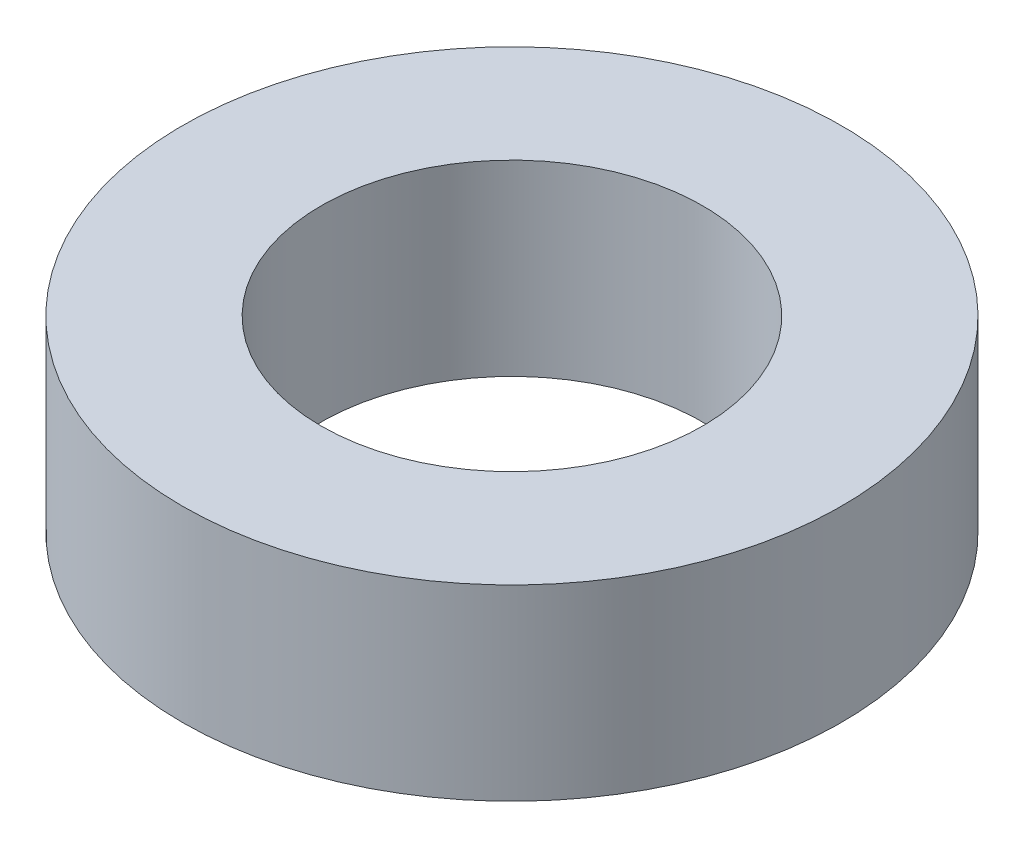
ISO-10303-21;
HEADER;
FILE_DESCRIPTION(('STEP AP214'),'2;1');
FILE_NAME('part.step','',(''),(''),'','','');
FILE_SCHEMA(('AUTOMOTIVE_DESIGN { 1 0 10303 214 1 1 1 1 }'));
ENDSEC;
DATA;
#1=APPLICATION_CONTEXT('core data for automotive mechanical design processes');
#2=APPLICATION_PROTOCOL_DEFINITION('international standard','automotive_design',2000,#1);
#3=PRODUCT_CONTEXT('',#1,'mechanical');
#4=PRODUCT('Part','Part','',(#3));
#5=PRODUCT_RELATED_PRODUCT_CATEGORY('part','',(#4));
#6=PRODUCT_DEFINITION_FORMATION('','',#4);
#7=PRODUCT_DEFINITION_CONTEXT('part definition',#1,'design');
#8=PRODUCT_DEFINITION('design','',#6,#7);
#9=PRODUCT_DEFINITION_SHAPE('','',#8);
#10=(LENGTH_UNIT() NAMED_UNIT(*) SI_UNIT(.MILLI.,.METRE.));
#11=(NAMED_UNIT(*) PLANE_ANGLE_UNIT() SI_UNIT($,.RADIAN.));
#12=(NAMED_UNIT(*) SI_UNIT($,.STERADIAN.) SOLID_ANGLE_UNIT());
#13=UNCERTAINTY_MEASURE_WITH_UNIT(LENGTH_MEASURE(1.E-05),#10,'distance_accuracy_value','');
#14=(GEOMETRIC_REPRESENTATION_CONTEXT(3) GLOBAL_UNCERTAINTY_ASSIGNED_CONTEXT((#13)) GLOBAL_UNIT_ASSIGNED_CONTEXT((#10,
#11,#12)) REPRESENTATION_CONTEXT('',''));
#15=CARTESIAN_POINT('',(0.,0.,0.));
#16=DIRECTION('',(0.,0.,1.));
#17=DIRECTION('',(1.,0.,0.));
#18=AXIS2_PLACEMENT_3D('',#15,#16,#17);
#19=CARTESIAN_POINT('',(0.,27.,0.));
#20=DIRECTION('',(0.,-1.,0.));
#21=DIRECTION('',(0.,0.,-1.));
#22=AXIS2_PLACEMENT_3D('',#19,#20,#21);
#23=CYLINDRICAL_SURFACE('',#22,47.5);
#24=CARTESIAN_POINT('',(0.,27.,0.));
#25=DIRECTION('',(0.,1.,0.));
#26=DIRECTION('',(0.,0.,1.));
#27=AXIS2_PLACEMENT_3D('',#24,#25,#26);
#28=CIRCLE('',#27,47.5);
#29=CARTESIAN_POINT('',(0.,27.,47.5));
#30=VERTEX_POINT('',#29);
#31=EDGE_CURVE('E10',#30,#30,#28,.T.);
#32=ORIENTED_EDGE('',*,*,#31,.F.);
#33=EDGE_LOOP('',(#32));
#34=FACE_BOUND('',#33,.T.);
#35=CARTESIAN_POINT('',(0.,0.,0.));
#36=DIRECTION('',(0.,1.,0.));
#37=DIRECTION('',(0.,0.,1.));
#38=AXIS2_PLACEMENT_3D('',#35,#36,#37);
#39=CIRCLE('',#38,47.5);
#40=CARTESIAN_POINT('',(0.,0.,47.5));
#41=VERTEX_POINT('',#40);
#42=EDGE_CURVE('E37',#41,#41,#39,.T.);
#43=ORIENTED_EDGE('',*,*,#42,.T.);
#44=EDGE_LOOP('',(#43));
#45=FACE_BOUND('',#44,.T.);
#46=ADVANCED_FACE('F40',(#34,#45),#23,.T.);
#47=CARTESIAN_POINT('',(0.,27.,0.));
#48=DIRECTION('',(0.,1.,0.));
#49=DIRECTION('',(0.,0.,1.));
#50=AXIS2_PLACEMENT_3D('',#47,#48,#49);
#51=PLANE('',#50);
#52=CARTESIAN_POINT('',(0.,27.,0.));
#53=DIRECTION('',(0.,1.,0.));
#54=DIRECTION('',(0.,0.,1.));
#55=AXIS2_PLACEMENT_3D('',#52,#53,#54);
#56=CIRCLE('',#55,27.5);
#57=CARTESIAN_POINT('',(0.,27.,27.5));
#58=VERTEX_POINT('',#57);
#59=EDGE_CURVE('E50',#58,#58,#56,.T.);
#60=ORIENTED_EDGE('',*,*,#59,.F.);
#61=EDGE_LOOP('',(#60));
#62=FACE_BOUND('',#61,.T.);
#63=ORIENTED_EDGE('',*,*,#31,.T.);
#64=EDGE_LOOP('',(#63));
#65=FACE_BOUND('',#64,.T.);
#66=ADVANCED_FACE('F59',(#62,#65),#51,.T.);
#67=CARTESIAN_POINT('',(0.,0.,0.));
#68=DIRECTION('',(0.,1.,0.));
#69=DIRECTION('',(0.,0.,1.));
#70=AXIS2_PLACEMENT_3D('',#67,#68,#69);
#71=PLANE('',#70);
#72=CARTESIAN_POINT('',(0.,0.,0.));
#73=DIRECTION('',(0.,1.,0.));
#74=DIRECTION('',(0.,0.,1.));
#75=AXIS2_PLACEMENT_3D('',#72,#73,#74);
#76=CIRCLE('',#75,27.5);
#77=CARTESIAN_POINT('',(0.,0.,27.5));
#78=VERTEX_POINT('',#77);
#79=EDGE_CURVE('E47',#78,#78,#76,.T.);
#80=ORIENTED_EDGE('',*,*,#79,.T.);
#81=EDGE_LOOP('',(#80));
#82=FACE_BOUND('',#81,.T.);
#83=ORIENTED_EDGE('',*,*,#42,.F.);
#84=EDGE_LOOP('',(#83));
#85=FACE_BOUND('',#84,.T.);
#86=ADVANCED_FACE('F58',(#82,#85),#71,.F.);
#87=CARTESIAN_POINT('',(0.,27.,0.));
#88=DIRECTION('',(0.,-1.,0.));
#89=DIRECTION('',(0.,0.,-1.));
#90=AXIS2_PLACEMENT_3D('',#87,#88,#89);
#91=CYLINDRICAL_SURFACE('',#90,27.5);
#92=ORIENTED_EDGE('',*,*,#59,.T.);
#93=EDGE_LOOP('',(#92));
#94=FACE_BOUND('',#93,.T.);
#95=ORIENTED_EDGE('',*,*,#79,.F.);
#96=EDGE_LOOP('',(#95));
#97=FACE_BOUND('',#96,.T.);
#98=ADVANCED_FACE('F54',(#94,#97),#91,.F.);
#99=CLOSED_SHELL('',(#46,#66,#86,#98));
#100=MANIFOLD_SOLID_BREP('B2',#99);
#101=ADVANCED_BREP_SHAPE_REPRESENTATION('',(#18,#100),#14);
#102=SHAPE_DEFINITION_REPRESENTATION(#9,#101);
ENDSEC;
END-ISO-10303-21;
